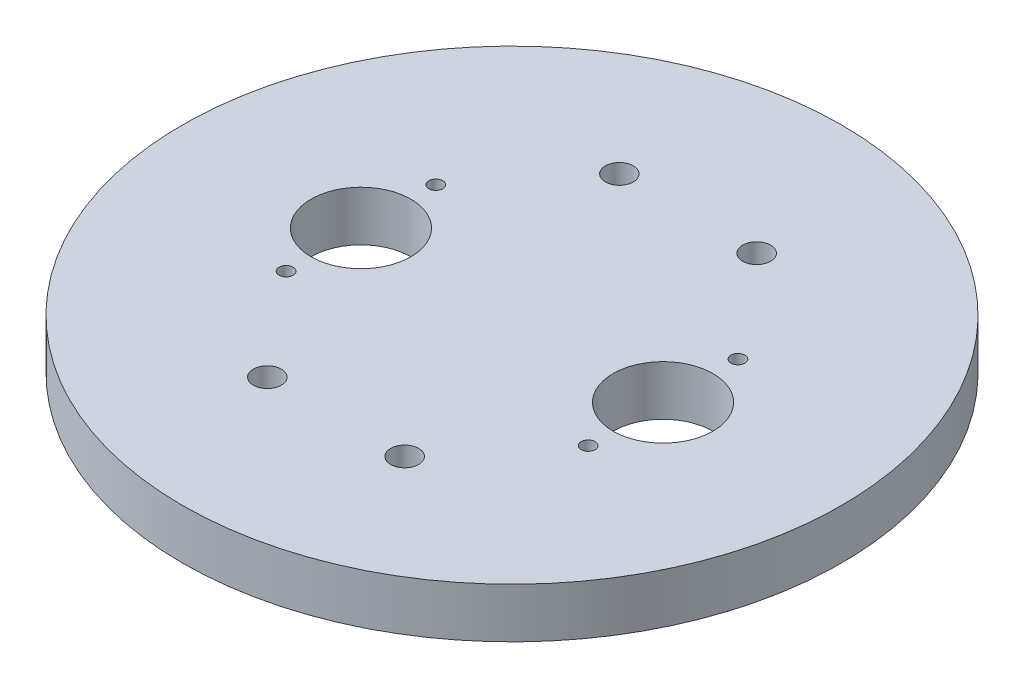
ISO-10303-21;
HEADER;
FILE_DESCRIPTION(('STEP AP214'),'2;1');
FILE_NAME('part.step','',(''),(''),'','','');
FILE_SCHEMA(('AUTOMOTIVE_DESIGN { 1 0 10303 214 1 1 1 1 }'));
ENDSEC;
DATA;
#1=APPLICATION_CONTEXT('core data for automotive mechanical design processes');
#2=APPLICATION_PROTOCOL_DEFINITION('international standard','automotive_design',2000,#1);
#3=PRODUCT_CONTEXT('',#1,'mechanical');
#4=PRODUCT('Part','Part','',(#3));
#5=PRODUCT_RELATED_PRODUCT_CATEGORY('part','',(#4));
#6=PRODUCT_DEFINITION_FORMATION('','',#4);
#7=PRODUCT_DEFINITION_CONTEXT('part definition',#1,'design');
#8=PRODUCT_DEFINITION('design','',#6,#7);
#9=PRODUCT_DEFINITION_SHAPE('','',#8);
#10=(LENGTH_UNIT() NAMED_UNIT(*) SI_UNIT(.MILLI.,.METRE.));
#11=(NAMED_UNIT(*) PLANE_ANGLE_UNIT() SI_UNIT($,.RADIAN.));
#12=(NAMED_UNIT(*) SI_UNIT($,.STERADIAN.) SOLID_ANGLE_UNIT());
#13=UNCERTAINTY_MEASURE_WITH_UNIT(LENGTH_MEASURE(1.E-05),#10,'distance_accuracy_value','');
#14=(GEOMETRIC_REPRESENTATION_CONTEXT(3) GLOBAL_UNCERTAINTY_ASSIGNED_CONTEXT((#13)) GLOBAL_UNIT_ASSIGNED_CONTEXT((#10,
#11,#12)) REPRESENTATION_CONTEXT('',''));
#15=CARTESIAN_POINT('',(0.,0.,0.));
#16=DIRECTION('',(0.,0.,1.));
#17=DIRECTION('',(1.,0.,0.));
#18=AXIS2_PLACEMENT_3D('',#15,#16,#17);
#19=CARTESIAN_POINT('',(0.,12.7,0.));
#20=DIRECTION('',(0.,-1.,0.));
#21=DIRECTION('',(0.,0.,-1.));
#22=AXIS2_PLACEMENT_3D('',#19,#20,#21);
#23=PLANE('',#22);
#24=CARTESIAN_POINT('',(102.235,12.7,-63.8175));
#25=DIRECTION('',(0.,1.,0.));
#26=DIRECTION('',(0.,0.,1.));
#27=AXIS2_PLACEMENT_3D('',#24,#25,#26);
#28=CIRCLE('',#27,12.7);
#29=CARTESIAN_POINT('',(102.235,12.7,-51.1175));
#30=VERTEX_POINT('',#29);
#31=EDGE_CURVE('E113',#30,#30,#28,.T.);
#32=ORIENTED_EDGE('',*,*,#31,.F.);
#33=EDGE_LOOP('',(#32));
#34=FACE_BOUND('',#33,.T.);
#35=CARTESIAN_POINT('',(25.4,12.7,-63.8175));
#36=DIRECTION('',(0.,1.,0.));
#37=DIRECTION('',(0.,0.,1.));
#38=AXIS2_PLACEMENT_3D('',#35,#36,#37);
#39=CIRCLE('',#38,12.7);
#40=CARTESIAN_POINT('',(25.4,12.7,-51.1175));
#41=VERTEX_POINT('',#40);
#42=EDGE_CURVE('E107',#41,#41,#39,.T.);
#43=ORIENTED_EDGE('',*,*,#42,.F.);
#44=EDGE_LOOP('',(#43));
#45=FACE_BOUND('',#44,.T.);
#46=CARTESIAN_POINT('',(102.235,12.7,-44.7675));
#47=DIRECTION('',(0.,1.,0.));
#48=DIRECTION('',(0.,0.,1.));
#49=AXIS2_PLACEMENT_3D('',#46,#47,#48);
#50=CIRCLE('',#49,1.778);
#51=CARTESIAN_POINT('',(102.235,12.7,-42.9895));
#52=VERTEX_POINT('',#51);
#53=EDGE_CURVE('E102',#52,#52,#50,.T.);
#54=ORIENTED_EDGE('',*,*,#53,.F.);
#55=EDGE_LOOP('',(#54));
#56=FACE_BOUND('',#55,.T.);
#57=CARTESIAN_POINT('',(25.4,12.7,-82.8675));
#58=DIRECTION('',(0.,1.,0.));
#59=DIRECTION('',(0.,0.,1.));
#60=AXIS2_PLACEMENT_3D('',#57,#58,#59);
#61=CIRCLE('',#60,1.778);
#62=CARTESIAN_POINT('',(25.4,12.7,-81.0895));
#63=VERTEX_POINT('',#62);
#64=EDGE_CURVE('E96',#63,#63,#61,.T.);
#65=ORIENTED_EDGE('',*,*,#64,.F.);
#66=EDGE_LOOP('',(#65));
#67=FACE_BOUND('',#66,.T.);
#68=CARTESIAN_POINT('',(102.235,12.7,-82.8675));
#69=DIRECTION('',(0.,1.,0.));
#70=DIRECTION('',(0.,0.,1.));
#71=AXIS2_PLACEMENT_3D('',#68,#69,#70);
#72=CIRCLE('',#71,1.778);
#73=CARTESIAN_POINT('',(102.235,12.7,-81.0895));
#74=VERTEX_POINT('',#73);
#75=EDGE_CURVE('E89',#74,#74,#72,.T.);
#76=ORIENTED_EDGE('',*,*,#75,.F.);
#77=EDGE_LOOP('',(#76));
#78=FACE_BOUND('',#77,.T.);
#79=CARTESIAN_POINT('',(25.4,12.7,-44.7675));
#80=DIRECTION('',(0.,1.,0.));
#81=DIRECTION('',(0.,0.,1.));
#82=AXIS2_PLACEMENT_3D('',#79,#80,#81);
#83=CIRCLE('',#82,1.778);
#84=CARTESIAN_POINT('',(25.4,12.7,-42.9895));
#85=VERTEX_POINT('',#84);
#86=EDGE_CURVE('E83',#85,#85,#83,.T.);
#87=ORIENTED_EDGE('',*,*,#86,.F.);
#88=EDGE_LOOP('',(#87));
#89=FACE_BOUND('',#88,.T.);
#90=CARTESIAN_POINT('',(46.355,12.7,-19.05));
#91=DIRECTION('',(0.,1.,0.));
#92=DIRECTION('',(0.,0.,1.));
#93=AXIS2_PLACEMENT_3D('',#90,#91,#92);
#94=CIRCLE('',#93,3.55600000000001);
#95=CARTESIAN_POINT('',(46.355,12.7,-15.494));
#96=VERTEX_POINT('',#95);
#97=EDGE_CURVE('E78',#96,#96,#94,.T.);
#98=ORIENTED_EDGE('',*,*,#97,.F.);
#99=EDGE_LOOP('',(#98));
#100=FACE_BOUND('',#99,.T.);
#101=CARTESIAN_POINT('',(81.28,12.7,-108.585));
#102=DIRECTION('',(0.,1.,0.));
#103=DIRECTION('',(0.,0.,1.));
#104=AXIS2_PLACEMENT_3D('',#101,#102,#103);
#105=CIRCLE('',#104,3.55600000000001);
#106=CARTESIAN_POINT('',(81.28,12.7,-105.029));
#107=VERTEX_POINT('',#106);
#108=EDGE_CURVE('E72',#107,#107,#105,.T.);
#109=ORIENTED_EDGE('',*,*,#108,.F.);
#110=EDGE_LOOP('',(#109));
#111=FACE_BOUND('',#110,.T.);
#112=CARTESIAN_POINT('',(81.28,12.7,-19.05));
#113=DIRECTION('',(0.,1.,0.));
#114=DIRECTION('',(0.,0.,1.));
#115=AXIS2_PLACEMENT_3D('',#112,#113,#114);
#116=CIRCLE('',#115,3.55600000000001);
#117=CARTESIAN_POINT('',(81.28,12.7,-15.494));
#118=VERTEX_POINT('',#117);
#119=EDGE_CURVE('E65',#118,#118,#116,.T.);
#120=ORIENTED_EDGE('',*,*,#119,.F.);
#121=EDGE_LOOP('',(#120));
#122=FACE_BOUND('',#121,.T.);
#123=CARTESIAN_POINT('',(46.355,12.7,-108.585));
#124=DIRECTION('',(0.,1.,0.));
#125=DIRECTION('',(0.,0.,1.));
#126=AXIS2_PLACEMENT_3D('',#123,#124,#125);
#127=CIRCLE('',#126,3.55600000000001);
#128=CARTESIAN_POINT('',(46.355,12.7,-105.029));
#129=VERTEX_POINT('',#128);
#130=EDGE_CURVE('E59',#129,#129,#127,.T.);
#131=ORIENTED_EDGE('',*,*,#130,.F.);
#132=EDGE_LOOP('',(#131));
#133=FACE_BOUND('',#132,.T.);
#134=CARTESIAN_POINT('',(63.8175,12.7,-63.8175));
#135=DIRECTION('',(0.,1.,0.));
#136=DIRECTION('',(0.,0.,1.));
#137=AXIS2_PLACEMENT_3D('',#134,#135,#136);
#138=CIRCLE('',#137,83.82);
#139=CARTESIAN_POINT('',(63.8175,12.7,20.0025));
#140=VERTEX_POINT('',#139);
#141=EDGE_CURVE('E51',#140,#140,#138,.T.);
#142=ORIENTED_EDGE('',*,*,#141,.T.);
#143=EDGE_LOOP('',(#142));
#144=FACE_BOUND('',#143,.T.);
#145=ADVANCED_FACE('F44',(#34,#45,#56,#67,#78,#89,#100,#111,#122,#133,#144),#23,.F.);
#146=CARTESIAN_POINT('',(0.,0.,0.));
#147=DIRECTION('',(0.,-1.,0.));
#148=DIRECTION('',(0.,0.,-1.));
#149=AXIS2_PLACEMENT_3D('',#146,#147,#148);
#150=PLANE('',#149);
#151=CARTESIAN_POINT('',(102.235,0.,-63.8175));
#152=DIRECTION('',(0.,1.,0.));
#153=DIRECTION('',(0.,0.,1.));
#154=AXIS2_PLACEMENT_3D('',#151,#152,#153);
#155=CIRCLE('',#154,12.7);
#156=CARTESIAN_POINT('',(102.235,0.,-51.1175));
#157=VERTEX_POINT('',#156);
#158=EDGE_CURVE('E110',#157,#157,#155,.T.);
#159=ORIENTED_EDGE('',*,*,#158,.T.);
#160=EDGE_LOOP('',(#159));
#161=FACE_BOUND('',#160,.T.);
#162=CARTESIAN_POINT('',(25.4,0.,-63.8175));
#163=DIRECTION('',(0.,1.,0.));
#164=DIRECTION('',(0.,0.,1.));
#165=AXIS2_PLACEMENT_3D('',#162,#163,#164);
#166=CIRCLE('',#165,12.7);
#167=CARTESIAN_POINT('',(25.4,0.,-51.1175));
#168=VERTEX_POINT('',#167);
#169=EDGE_CURVE('E93',#168,#168,#166,.T.);
#170=ORIENTED_EDGE('',*,*,#169,.T.);
#171=EDGE_LOOP('',(#170));
#172=FACE_BOUND('',#171,.T.);
#173=CARTESIAN_POINT('',(102.235,0.,-44.7675));
#174=DIRECTION('',(0.,1.,0.));
#175=DIRECTION('',(0.,0.,1.));
#176=AXIS2_PLACEMENT_3D('',#173,#174,#175);
#177=CIRCLE('',#176,1.778);
#178=CARTESIAN_POINT('',(102.235,0.,-42.9895));
#179=VERTEX_POINT('',#178);
#180=EDGE_CURVE('E86',#179,#179,#177,.T.);
#181=ORIENTED_EDGE('',*,*,#180,.T.);
#182=EDGE_LOOP('',(#181));
#183=FACE_BOUND('',#182,.T.);
#184=CARTESIAN_POINT('',(25.4,0.,-82.8675));
#185=DIRECTION('',(0.,1.,0.));
#186=DIRECTION('',(0.,0.,1.));
#187=AXIS2_PLACEMENT_3D('',#184,#185,#186);
#188=CIRCLE('',#187,1.778);
#189=CARTESIAN_POINT('',(25.4,0.,-81.0895));
#190=VERTEX_POINT('',#189);
#191=EDGE_CURVE('E99',#190,#190,#188,.T.);
#192=ORIENTED_EDGE('',*,*,#191,.T.);
#193=EDGE_LOOP('',(#192));
#194=FACE_BOUND('',#193,.T.);
#195=CARTESIAN_POINT('',(102.235,0.,-82.8675));
#196=DIRECTION('',(0.,1.,0.));
#197=DIRECTION('',(0.,0.,1.));
#198=AXIS2_PLACEMENT_3D('',#195,#196,#197);
#199=CIRCLE('',#198,1.778);
#200=CARTESIAN_POINT('',(102.235,0.,-81.0895));
#201=VERTEX_POINT('',#200);
#202=EDGE_CURVE('E92',#201,#201,#199,.T.);
#203=ORIENTED_EDGE('',*,*,#202,.T.);
#204=EDGE_LOOP('',(#203));
#205=FACE_BOUND('',#204,.T.);
#206=CARTESIAN_POINT('',(25.4,0.,-44.7675));
#207=DIRECTION('',(0.,1.,0.));
#208=DIRECTION('',(0.,0.,1.));
#209=AXIS2_PLACEMENT_3D('',#206,#207,#208);
#210=CIRCLE('',#209,1.778);
#211=CARTESIAN_POINT('',(25.4,0.,-42.9895));
#212=VERTEX_POINT('',#211);
#213=EDGE_CURVE('E69',#212,#212,#210,.T.);
#214=ORIENTED_EDGE('',*,*,#213,.T.);
#215=EDGE_LOOP('',(#214));
#216=FACE_BOUND('',#215,.T.);
#217=CARTESIAN_POINT('',(46.355,0.,-19.05));
#218=DIRECTION('',(0.,1.,0.));
#219=DIRECTION('',(0.,0.,1.));
#220=AXIS2_PLACEMENT_3D('',#217,#218,#219);
#221=CIRCLE('',#220,3.55600000000001);
#222=CARTESIAN_POINT('',(46.355,0.,-15.494));
#223=VERTEX_POINT('',#222);
#224=EDGE_CURVE('E63',#223,#223,#221,.T.);
#225=ORIENTED_EDGE('',*,*,#224,.T.);
#226=EDGE_LOOP('',(#225));
#227=FACE_BOUND('',#226,.T.);
#228=CARTESIAN_POINT('',(81.28,0.,-108.585));
#229=DIRECTION('',(0.,1.,0.));
#230=DIRECTION('',(0.,0.,1.));
#231=AXIS2_PLACEMENT_3D('',#228,#229,#230);
#232=CIRCLE('',#231,3.55600000000001);
#233=CARTESIAN_POINT('',(81.28,0.,-105.029));
#234=VERTEX_POINT('',#233);
#235=EDGE_CURVE('E75',#234,#234,#232,.T.);
#236=ORIENTED_EDGE('',*,*,#235,.T.);
#237=EDGE_LOOP('',(#236));
#238=FACE_BOUND('',#237,.T.);
#239=CARTESIAN_POINT('',(81.28,0.,-19.05));
#240=DIRECTION('',(0.,1.,0.));
#241=DIRECTION('',(0.,0.,1.));
#242=AXIS2_PLACEMENT_3D('',#239,#240,#241);
#243=CIRCLE('',#242,3.55600000000001);
#244=CARTESIAN_POINT('',(81.28,0.,-15.494));
#245=VERTEX_POINT('',#244);
#246=EDGE_CURVE('E68',#245,#245,#243,.T.);
#247=ORIENTED_EDGE('',*,*,#246,.T.);
#248=EDGE_LOOP('',(#247));
#249=FACE_BOUND('',#248,.T.);
#250=CARTESIAN_POINT('',(46.355,0.,-108.585));
#251=DIRECTION('',(0.,1.,0.));
#252=DIRECTION('',(0.,0.,1.));
#253=AXIS2_PLACEMENT_3D('',#250,#251,#252);
#254=CIRCLE('',#253,3.55600000000001);
#255=CARTESIAN_POINT('',(46.355,0.,-105.029));
#256=VERTEX_POINT('',#255);
#257=EDGE_CURVE('E55',#256,#256,#254,.T.);
#258=ORIENTED_EDGE('',*,*,#257,.T.);
#259=EDGE_LOOP('',(#258));
#260=FACE_BOUND('',#259,.T.);
#261=CARTESIAN_POINT('',(63.8175,0.,-63.8175));
#262=DIRECTION('',(0.,-1.,0.));
#263=DIRECTION('',(0.,0.,-1.));
#264=AXIS2_PLACEMENT_3D('',#261,#262,#263);
#265=CIRCLE('',#264,83.82);
#266=CARTESIAN_POINT('',(63.8175,0.,-147.6375));
#267=VERTEX_POINT('',#266);
#268=EDGE_CURVE('E11',#267,#267,#265,.F.);
#269=ORIENTED_EDGE('',*,*,#268,.F.);
#270=EDGE_LOOP('',(#269));
#271=FACE_BOUND('',#270,.T.);
#272=ADVANCED_FACE('F46',(#161,#172,#183,#194,#205,#216,#227,#238,#249,#260,#271),#150,.T.);
#273=CARTESIAN_POINT('',(63.8175,-237.078761596226,-63.8175));
#274=DIRECTION('',(0.,1.,0.));
#275=DIRECTION('',(0.,0.,1.));
#276=AXIS2_PLACEMENT_3D('',#273,#274,#275);
#277=CYLINDRICAL_SURFACE('',#276,83.82);
#278=ORIENTED_EDGE('',*,*,#141,.F.);
#279=EDGE_LOOP('',(#278));
#280=FACE_BOUND('',#279,.T.);
#281=ORIENTED_EDGE('',*,*,#268,.T.);
#282=EDGE_LOOP('',(#281));
#283=FACE_BOUND('',#282,.T.);
#284=ADVANCED_FACE('F151',(#280,#283),#277,.T.);
#285=CARTESIAN_POINT('',(46.355,0.,-108.585));
#286=DIRECTION('',(0.,1.,0.));
#287=DIRECTION('',(0.,0.,1.));
#288=AXIS2_PLACEMENT_3D('',#285,#286,#287);
#289=CYLINDRICAL_SURFACE('',#288,3.55600000000001);
#290=ORIENTED_EDGE('',*,*,#257,.F.);
#291=EDGE_LOOP('',(#290));
#292=FACE_BOUND('',#291,.T.);
#293=ORIENTED_EDGE('',*,*,#130,.T.);
#294=EDGE_LOOP('',(#293));
#295=FACE_BOUND('',#294,.T.);
#296=ADVANCED_FACE('F148',(#292,#295),#289,.F.);
#297=CARTESIAN_POINT('',(81.28,0.,-19.05));
#298=DIRECTION('',(0.,1.,0.));
#299=DIRECTION('',(0.,0.,1.));
#300=AXIS2_PLACEMENT_3D('',#297,#298,#299);
#301=CYLINDRICAL_SURFACE('',#300,3.55600000000001);
#302=ORIENTED_EDGE('',*,*,#246,.F.);
#303=EDGE_LOOP('',(#302));
#304=FACE_BOUND('',#303,.T.);
#305=ORIENTED_EDGE('',*,*,#119,.T.);
#306=EDGE_LOOP('',(#305));
#307=FACE_BOUND('',#306,.T.);
#308=ADVANCED_FACE('F150',(#304,#307),#301,.F.);
#309=CARTESIAN_POINT('',(81.28,0.,-108.585));
#310=DIRECTION('',(0.,1.,0.));
#311=DIRECTION('',(0.,0.,1.));
#312=AXIS2_PLACEMENT_3D('',#309,#310,#311);
#313=CYLINDRICAL_SURFACE('',#312,3.55600000000001);
#314=ORIENTED_EDGE('',*,*,#235,.F.);
#315=EDGE_LOOP('',(#314));
#316=FACE_BOUND('',#315,.T.);
#317=ORIENTED_EDGE('',*,*,#108,.T.);
#318=EDGE_LOOP('',(#317));
#319=FACE_BOUND('',#318,.T.);
#320=ADVANCED_FACE('F158',(#316,#319),#313,.F.);
#321=CARTESIAN_POINT('',(46.355,0.,-19.05));
#322=DIRECTION('',(0.,1.,0.));
#323=DIRECTION('',(0.,0.,1.));
#324=AXIS2_PLACEMENT_3D('',#321,#322,#323);
#325=CYLINDRICAL_SURFACE('',#324,3.55600000000001);
#326=ORIENTED_EDGE('',*,*,#224,.F.);
#327=EDGE_LOOP('',(#326));
#328=FACE_BOUND('',#327,.T.);
#329=ORIENTED_EDGE('',*,*,#97,.T.);
#330=EDGE_LOOP('',(#329));
#331=FACE_BOUND('',#330,.T.);
#332=ADVANCED_FACE('F167',(#328,#331),#325,.F.);
#333=CARTESIAN_POINT('',(25.4,0.,-44.7675));
#334=DIRECTION('',(0.,1.,0.));
#335=DIRECTION('',(0.,0.,1.));
#336=AXIS2_PLACEMENT_3D('',#333,#334,#335);
#337=CYLINDRICAL_SURFACE('',#336,1.778);
#338=ORIENTED_EDGE('',*,*,#213,.F.);
#339=EDGE_LOOP('',(#338));
#340=FACE_BOUND('',#339,.T.);
#341=ORIENTED_EDGE('',*,*,#86,.T.);
#342=EDGE_LOOP('',(#341));
#343=FACE_BOUND('',#342,.T.);
#344=ADVANCED_FACE('F171',(#340,#343),#337,.F.);
#345=CARTESIAN_POINT('',(102.235,0.,-82.8675));
#346=DIRECTION('',(0.,1.,0.));
#347=DIRECTION('',(0.,0.,1.));
#348=AXIS2_PLACEMENT_3D('',#345,#346,#347);
#349=CYLINDRICAL_SURFACE('',#348,1.778);
#350=ORIENTED_EDGE('',*,*,#202,.F.);
#351=EDGE_LOOP('',(#350));
#352=FACE_BOUND('',#351,.T.);
#353=ORIENTED_EDGE('',*,*,#75,.T.);
#354=EDGE_LOOP('',(#353));
#355=FACE_BOUND('',#354,.T.);
#356=ADVANCED_FACE('F175',(#352,#355),#349,.F.);
#357=CARTESIAN_POINT('',(25.4,0.,-82.8675));
#358=DIRECTION('',(0.,1.,0.));
#359=DIRECTION('',(0.,0.,1.));
#360=AXIS2_PLACEMENT_3D('',#357,#358,#359);
#361=CYLINDRICAL_SURFACE('',#360,1.778);
#362=ORIENTED_EDGE('',*,*,#191,.F.);
#363=EDGE_LOOP('',(#362));
#364=FACE_BOUND('',#363,.T.);
#365=ORIENTED_EDGE('',*,*,#64,.T.);
#366=EDGE_LOOP('',(#365));
#367=FACE_BOUND('',#366,.T.);
#368=ADVANCED_FACE('F179',(#364,#367),#361,.F.);
#369=CARTESIAN_POINT('',(102.235,0.,-44.7675));
#370=DIRECTION('',(0.,1.,0.));
#371=DIRECTION('',(0.,0.,1.));
#372=AXIS2_PLACEMENT_3D('',#369,#370,#371);
#373=CYLINDRICAL_SURFACE('',#372,1.778);
#374=ORIENTED_EDGE('',*,*,#180,.F.);
#375=EDGE_LOOP('',(#374));
#376=FACE_BOUND('',#375,.T.);
#377=ORIENTED_EDGE('',*,*,#53,.T.);
#378=EDGE_LOOP('',(#377));
#379=FACE_BOUND('',#378,.T.);
#380=ADVANCED_FACE('F183',(#376,#379),#373,.F.);
#381=CARTESIAN_POINT('',(25.4,0.,-63.8175));
#382=DIRECTION('',(0.,1.,0.));
#383=DIRECTION('',(0.,0.,1.));
#384=AXIS2_PLACEMENT_3D('',#381,#382,#383);
#385=CYLINDRICAL_SURFACE('',#384,12.7);
#386=ORIENTED_EDGE('',*,*,#169,.F.);
#387=EDGE_LOOP('',(#386));
#388=FACE_BOUND('',#387,.T.);
#389=ORIENTED_EDGE('',*,*,#42,.T.);
#390=EDGE_LOOP('',(#389));
#391=FACE_BOUND('',#390,.T.);
#392=ADVANCED_FACE('F124',(#388,#391),#385,.F.);
#393=CARTESIAN_POINT('',(102.235,0.,-63.8175));
#394=DIRECTION('',(0.,1.,0.));
#395=DIRECTION('',(0.,0.,1.));
#396=AXIS2_PLACEMENT_3D('',#393,#394,#395);
#397=CYLINDRICAL_SURFACE('',#396,12.7);
#398=ORIENTED_EDGE('',*,*,#158,.F.);
#399=EDGE_LOOP('',(#398));
#400=FACE_BOUND('',#399,.T.);
#401=ORIENTED_EDGE('',*,*,#31,.T.);
#402=EDGE_LOOP('',(#401));
#403=FACE_BOUND('',#402,.T.);
#404=ADVANCED_FACE('F121',(#400,#403),#397,.F.);
#405=CLOSED_SHELL('',(#145,#272,#284,#296,#308,#320,#332,#344,#356,#368,#380,#392,#404));
#406=MANIFOLD_SOLID_BREP('B2',#405);
#407=ADVANCED_BREP_SHAPE_REPRESENTATION('',(#18,#406),#14);
#408=SHAPE_DEFINITION_REPRESENTATION(#9,#407);
ENDSEC;
END-ISO-10303-21;
